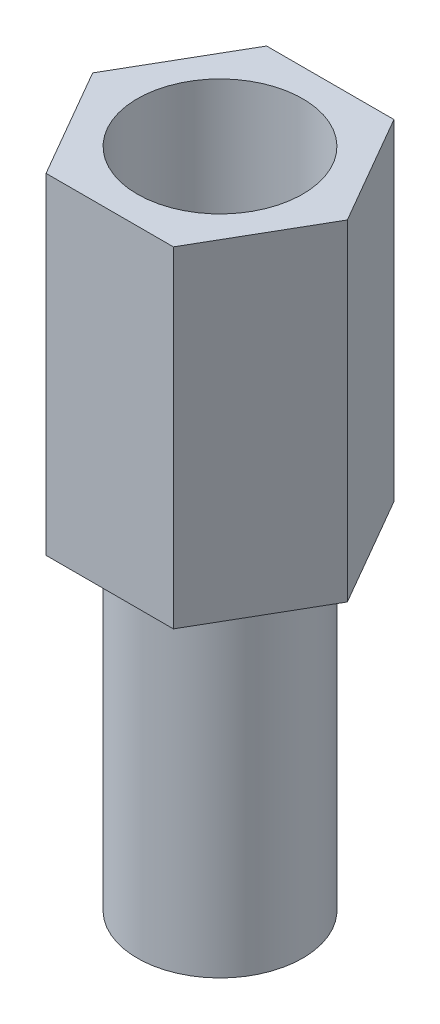
ISO-10303-21;
HEADER;
FILE_DESCRIPTION(('STEP AP214'),'2;1');
FILE_NAME('part.step','',(''),(''),'','','');
FILE_SCHEMA(('AUTOMOTIVE_DESIGN { 1 0 10303 214 1 1 1 1 }'));
ENDSEC;
DATA;
#1=APPLICATION_CONTEXT('core data for automotive mechanical design processes');
#2=APPLICATION_PROTOCOL_DEFINITION('international standard','automotive_design',2000,#1);
#3=PRODUCT_CONTEXT('',#1,'mechanical');
#4=PRODUCT('Part','Part','',(#3));
#5=PRODUCT_RELATED_PRODUCT_CATEGORY('part','',(#4));
#6=PRODUCT_DEFINITION_FORMATION('','',#4);
#7=PRODUCT_DEFINITION_CONTEXT('part definition',#1,'design');
#8=PRODUCT_DEFINITION('design','',#6,#7);
#9=PRODUCT_DEFINITION_SHAPE('','',#8);
#10=(LENGTH_UNIT() NAMED_UNIT(*) SI_UNIT(.MILLI.,.METRE.));
#11=(NAMED_UNIT(*) PLANE_ANGLE_UNIT() SI_UNIT($,.RADIAN.));
#12=(NAMED_UNIT(*) SI_UNIT($,.STERADIAN.) SOLID_ANGLE_UNIT());
#13=UNCERTAINTY_MEASURE_WITH_UNIT(LENGTH_MEASURE(1.E-05),#10,'distance_accuracy_value','');
#14=(GEOMETRIC_REPRESENTATION_CONTEXT(3) GLOBAL_UNCERTAINTY_ASSIGNED_CONTEXT((#13)) GLOBAL_UNIT_ASSIGNED_CONTEXT((#10,
#11,#12)) REPRESENTATION_CONTEXT('',''));
#15=CARTESIAN_POINT('',(0.,0.,0.));
#16=DIRECTION('',(0.,0.,1.));
#17=DIRECTION('',(1.,0.,0.));
#18=AXIS2_PLACEMENT_3D('',#15,#16,#17);
#19=CARTESIAN_POINT('',(0.,-6.,0.));
#20=DIRECTION('',(0.,1.,0.));
#21=DIRECTION('',(0.,0.,1.));
#22=AXIS2_PLACEMENT_3D('',#19,#20,#21);
#23=CYLINDRICAL_SURFACE('',#22,1.5);
#24=CARTESIAN_POINT('',(0.,-6.,0.));
#25=DIRECTION('',(0.,-1.,0.));
#26=DIRECTION('',(0.,0.,-1.));
#27=AXIS2_PLACEMENT_3D('',#24,#25,#26);
#28=CIRCLE('',#27,1.5);
#29=CARTESIAN_POINT('',(0.,-6.,-1.5));
#30=VERTEX_POINT('',#29);
#31=EDGE_CURVE('E11',#30,#30,#28,.T.);
#32=ORIENTED_EDGE('',*,*,#31,.F.);
#33=EDGE_LOOP('',(#32));
#34=FACE_BOUND('',#33,.T.);
#35=CARTESIAN_POINT('',(0.,0.,0.));
#36=DIRECTION('',(0.,-1.,0.));
#37=DIRECTION('',(0.,0.,-1.));
#38=AXIS2_PLACEMENT_3D('',#35,#36,#37);
#39=CIRCLE('',#38,1.5);
#40=CARTESIAN_POINT('',(0.,0.,-1.5));
#41=VERTEX_POINT('',#40);
#42=EDGE_CURVE('E43',#41,#41,#39,.T.);
#43=ORIENTED_EDGE('',*,*,#42,.T.);
#44=EDGE_LOOP('',(#43));
#45=FACE_BOUND('',#44,.T.);
#46=ADVANCED_FACE('F40',(#34,#45),#23,.T.);
#47=CARTESIAN_POINT('',(0.,-6.,0.));
#48=DIRECTION('',(0.,-1.,0.));
#49=DIRECTION('',(0.,0.,-1.));
#50=AXIS2_PLACEMENT_3D('',#47,#48,#49);
#51=PLANE('',#50);
#52=ORIENTED_EDGE('',*,*,#31,.T.);
#53=EDGE_LOOP('',(#52));
#54=FACE_BOUND('',#53,.T.);
#55=ADVANCED_FACE('F55',(#54),#51,.T.);
#56=CARTESIAN_POINT('',(0.,0.,0.));
#57=DIRECTION('',(0.,-1.,0.));
#58=DIRECTION('',(0.,0.,-1.));
#59=AXIS2_PLACEMENT_3D('',#56,#57,#58);
#60=PLANE('',#59);
#61=ORIENTED_EDGE('',*,*,#42,.F.);
#62=EDGE_LOOP('',(#61));
#63=FACE_BOUND('',#62,.T.);
#64=ADVANCED_FACE('F53',(#63),#60,.F.);
#65=CLOSED_SHELL('',(#46,#55,#64));
#66=MANIFOLD_SOLID_BREP('B2',#65);
#67=CARTESIAN_POINT('',(0.,6.,0.));
#68=DIRECTION('',(0.,1.,0.));
#69=DIRECTION('',(0.,0.,1.));
#70=AXIS2_PLACEMENT_3D('',#67,#68,#69);
#71=PLANE('',#70);
#72=DIRECTION('',(-0.5,0.,-0.866025403784439));
#73=VECTOR('',#72,1.);
#74=CARTESIAN_POINT('',(2.3094010767585,6.,0.));
#75=LINE('',#74,#73);
#76=CARTESIAN_POINT('',(2.3094010767585,6.,0.));
#77=VERTEX_POINT('',#76);
#78=CARTESIAN_POINT('',(1.15470053837925,6.,-2.));
#79=VERTEX_POINT('',#78);
#80=EDGE_CURVE('E176',#77,#79,#75,.T.);
#81=ORIENTED_EDGE('',*,*,#80,.T.);
#82=DIRECTION('',(-1.,0.,0.));
#83=VECTOR('',#82,1.);
#84=CARTESIAN_POINT('',(1.15470053837925,6.,-2.));
#85=LINE('',#84,#83);
#86=CARTESIAN_POINT('',(-1.15470053837925,6.,-2.));
#87=VERTEX_POINT('',#86);
#88=EDGE_CURVE('E134',#79,#87,#85,.T.);
#89=ORIENTED_EDGE('',*,*,#88,.T.);
#90=DIRECTION('',(-0.499999999999999,0.,0.866025403784439));
#91=VECTOR('',#90,1.);
#92=CARTESIAN_POINT('',(-1.15470053837925,6.,-2.));
#93=LINE('',#92,#91);
#94=CARTESIAN_POINT('',(-2.3094010767585,6.,0.));
#95=VERTEX_POINT('',#94);
#96=EDGE_CURVE('E147',#87,#95,#93,.T.);
#97=ORIENTED_EDGE('',*,*,#96,.T.);
#98=DIRECTION('',(0.5,0.,0.866025403784438));
#99=VECTOR('',#98,1.);
#100=CARTESIAN_POINT('',(-2.3094010767585,6.,0.));
#101=LINE('',#100,#99);
#102=CARTESIAN_POINT('',(-1.15470053837925,6.,2.));
#103=VERTEX_POINT('',#102);
#104=EDGE_CURVE('E141',#95,#103,#101,.T.);
#105=ORIENTED_EDGE('',*,*,#104,.T.);
#106=DIRECTION('',(1.,0.,0.));
#107=VECTOR('',#106,1.);
#108=CARTESIAN_POINT('',(-1.15470053837925,6.,2.));
#109=LINE('',#108,#107);
#110=CARTESIAN_POINT('',(1.15470053837925,6.,2.));
#111=VERTEX_POINT('',#110);
#112=EDGE_CURVE('E145',#103,#111,#109,.T.);
#113=ORIENTED_EDGE('',*,*,#112,.T.);
#114=DIRECTION('',(0.5,0.,-0.866025403784439));
#115=VECTOR('',#114,1.);
#116=CARTESIAN_POINT('',(1.15470053837925,6.,2.));
#117=LINE('',#116,#115);
#118=EDGE_CURVE('E97',#111,#77,#117,.T.);
#119=ORIENTED_EDGE('',*,*,#118,.T.);
#120=EDGE_LOOP('',(#81,#89,#97,#105,#113,#119));
#121=FACE_BOUND('',#120,.T.);
#122=CARTESIAN_POINT('',(0.,6.,0.));
#123=DIRECTION('',(0.,1.,0.));
#124=DIRECTION('',(0.,0.,1.));
#125=AXIS2_PLACEMENT_3D('',#122,#123,#124);
#126=CIRCLE('',#125,1.5);
#127=CARTESIAN_POINT('',(0.,6.,1.5));
#128=VERTEX_POINT('',#127);
#129=EDGE_CURVE('E169',#128,#128,#126,.T.);
#130=ORIENTED_EDGE('',*,*,#129,.F.);
#131=EDGE_LOOP('',(#130));
#132=FACE_BOUND('',#131,.T.);
#133=ADVANCED_FACE('F80',(#121,#132),#71,.T.);
#134=CARTESIAN_POINT('',(0.,0.,0.));
#135=DIRECTION('',(0.,1.,0.));
#136=DIRECTION('',(0.,0.,1.));
#137=AXIS2_PLACEMENT_3D('',#134,#135,#136);
#138=PLANE('',#137);
#139=DIRECTION('',(-0.5,0.,-0.866025403784439));
#140=VECTOR('',#139,1.);
#141=CARTESIAN_POINT('',(2.3094010767585,0.,0.));
#142=LINE('',#141,#140);
#143=CARTESIAN_POINT('',(2.3094010767585,0.,0.));
#144=VERTEX_POINT('',#143);
#145=CARTESIAN_POINT('',(1.15470053837925,0.,-2.));
#146=VERTEX_POINT('',#145);
#147=EDGE_CURVE('E165',#144,#146,#142,.T.);
#148=ORIENTED_EDGE('',*,*,#147,.F.);
#149=DIRECTION('',(0.5,0.,-0.866025403784439));
#150=VECTOR('',#149,1.);
#151=CARTESIAN_POINT('',(1.15470053837925,0.,2.));
#152=LINE('',#151,#150);
#153=CARTESIAN_POINT('',(1.15470053837925,0.,2.));
#154=VERTEX_POINT('',#153);
#155=EDGE_CURVE('E126',#154,#144,#152,.T.);
#156=ORIENTED_EDGE('',*,*,#155,.F.);
#157=DIRECTION('',(1.,0.,0.));
#158=VECTOR('',#157,1.);
#159=CARTESIAN_POINT('',(-1.15470053837925,0.,2.));
#160=LINE('',#159,#158);
#161=CARTESIAN_POINT('',(-1.15470053837925,0.,2.));
#162=VERTEX_POINT('',#161);
#163=EDGE_CURVE('E120',#162,#154,#160,.T.);
#164=ORIENTED_EDGE('',*,*,#163,.F.);
#165=DIRECTION('',(0.5,0.,0.866025403784438));
#166=VECTOR('',#165,1.);
#167=CARTESIAN_POINT('',(-2.3094010767585,0.,0.));
#168=LINE('',#167,#166);
#169=CARTESIAN_POINT('',(-2.3094010767585,0.,0.));
#170=VERTEX_POINT('',#169);
#171=EDGE_CURVE('E155',#170,#162,#168,.T.);
#172=ORIENTED_EDGE('',*,*,#171,.F.);
#173=DIRECTION('',(-0.499999999999999,0.,0.866025403784439));
#174=VECTOR('',#173,1.);
#175=CARTESIAN_POINT('',(-1.15470053837925,0.,-2.));
#176=LINE('',#175,#174);
#177=CARTESIAN_POINT('',(-1.15470053837925,0.,-2.));
#178=VERTEX_POINT('',#177);
#179=EDGE_CURVE('E171',#178,#170,#176,.T.);
#180=ORIENTED_EDGE('',*,*,#179,.F.);
#181=DIRECTION('',(-1.,0.,0.));
#182=VECTOR('',#181,1.);
#183=CARTESIAN_POINT('',(1.15470053837925,0.,-2.));
#184=LINE('',#183,#182);
#185=EDGE_CURVE('E168',#146,#178,#184,.T.);
#186=ORIENTED_EDGE('',*,*,#185,.F.);
#187=EDGE_LOOP('',(#148,#156,#164,#172,#180,#186));
#188=FACE_BOUND('',#187,.T.);
#189=CARTESIAN_POINT('',(0.,0.,0.));
#190=DIRECTION('',(0.,1.,0.));
#191=DIRECTION('',(0.,0.,1.));
#192=AXIS2_PLACEMENT_3D('',#189,#190,#191);
#193=CIRCLE('',#192,1.5);
#194=CARTESIAN_POINT('',(0.,0.,1.5));
#195=VERTEX_POINT('',#194);
#196=EDGE_CURVE('E269',#195,#195,#193,.T.);
#197=ORIENTED_EDGE('',*,*,#196,.T.);
#198=EDGE_LOOP('',(#197));
#199=FACE_BOUND('',#198,.T.);
#200=ADVANCED_FACE('F185',(#188,#199),#138,.F.);
#201=CARTESIAN_POINT('',(2.3094010767585,6.,0.));
#202=DIRECTION('',(-0.866025403784439,0.,0.5));
#203=DIRECTION('',(0.5,0.,0.866025403784439));
#204=AXIS2_PLACEMENT_3D('',#201,#202,#203);
#205=PLANE('',#204);
#206=ORIENTED_EDGE('',*,*,#147,.T.);
#207=DIRECTION('',(0.,-1.,0.));
#208=VECTOR('',#207,1.);
#209=CARTESIAN_POINT('',(1.15470053837925,6.,-2.));
#210=LINE('',#209,#208);
#211=EDGE_CURVE('E38',#79,#146,#210,.T.);
#212=ORIENTED_EDGE('',*,*,#211,.F.);
#213=ORIENTED_EDGE('',*,*,#80,.F.);
#214=DIRECTION('',(0.,-1.,0.));
#215=VECTOR('',#214,1.);
#216=CARTESIAN_POINT('',(2.3094010767585,6.,0.));
#217=LINE('',#216,#215);
#218=EDGE_CURVE('E161',#77,#144,#217,.T.);
#219=ORIENTED_EDGE('',*,*,#218,.T.);
#220=EDGE_LOOP('',(#206,#212,#213,#219));
#221=FACE_BOUND('',#220,.T.);
#222=ADVANCED_FACE('F82',(#221),#205,.F.);
#223=CARTESIAN_POINT('',(1.15470053837925,6.,-2.));
#224=DIRECTION('',(0.,0.,1.));
#225=DIRECTION('',(1.,0.,0.));
#226=AXIS2_PLACEMENT_3D('',#223,#224,#225);
#227=PLANE('',#226);
#228=ORIENTED_EDGE('',*,*,#185,.T.);
#229=DIRECTION('',(0.,-1.,0.));
#230=VECTOR('',#229,1.);
#231=CARTESIAN_POINT('',(-1.15470053837925,6.,-2.));
#232=LINE('',#231,#230);
#233=EDGE_CURVE('E89',#87,#178,#232,.T.);
#234=ORIENTED_EDGE('',*,*,#233,.F.);
#235=ORIENTED_EDGE('',*,*,#88,.F.);
#236=ORIENTED_EDGE('',*,*,#211,.T.);
#237=EDGE_LOOP('',(#228,#234,#235,#236));
#238=FACE_BOUND('',#237,.T.);
#239=ADVANCED_FACE('F210',(#238),#227,.F.);
#240=CARTESIAN_POINT('',(-1.15470053837925,6.,-2.));
#241=DIRECTION('',(0.866025403784439,0.,0.5));
#242=DIRECTION('',(0.5,0.,-0.866025403784439));
#243=AXIS2_PLACEMENT_3D('',#240,#241,#242);
#244=PLANE('',#243);
#245=ORIENTED_EDGE('',*,*,#179,.T.);
#246=DIRECTION('',(0.,-1.,0.));
#247=VECTOR('',#246,1.);
#248=CARTESIAN_POINT('',(-2.3094010767585,6.,0.));
#249=LINE('',#248,#247);
#250=EDGE_CURVE('E156',#95,#170,#249,.T.);
#251=ORIENTED_EDGE('',*,*,#250,.F.);
#252=ORIENTED_EDGE('',*,*,#96,.F.);
#253=ORIENTED_EDGE('',*,*,#233,.T.);
#254=EDGE_LOOP('',(#245,#251,#252,#253));
#255=FACE_BOUND('',#254,.T.);
#256=ADVANCED_FACE('F182',(#255),#244,.F.);
#257=CARTESIAN_POINT('',(-2.3094010767585,6.,0.));
#258=DIRECTION('',(0.866025403784438,0.,-0.5));
#259=DIRECTION('',(-0.5,0.,-0.866025403784438));
#260=AXIS2_PLACEMENT_3D('',#257,#258,#259);
#261=PLANE('',#260);
#262=ORIENTED_EDGE('',*,*,#171,.T.);
#263=DIRECTION('',(0.,-1.,0.));
#264=VECTOR('',#263,1.);
#265=CARTESIAN_POINT('',(-1.15470053837925,6.,2.));
#266=LINE('',#265,#264);
#267=EDGE_CURVE('E152',#103,#162,#266,.T.);
#268=ORIENTED_EDGE('',*,*,#267,.F.);
#269=ORIENTED_EDGE('',*,*,#104,.F.);
#270=ORIENTED_EDGE('',*,*,#250,.T.);
#271=EDGE_LOOP('',(#262,#268,#269,#270));
#272=FACE_BOUND('',#271,.T.);
#273=ADVANCED_FACE('F153',(#272),#261,.F.);
#274=CARTESIAN_POINT('',(-1.15470053837925,6.,2.));
#275=DIRECTION('',(0.,0.,-1.));
#276=DIRECTION('',(-1.,0.,0.));
#277=AXIS2_PLACEMENT_3D('',#274,#275,#276);
#278=PLANE('',#277);
#279=ORIENTED_EDGE('',*,*,#163,.T.);
#280=DIRECTION('',(0.,-1.,0.));
#281=VECTOR('',#280,1.);
#282=CARTESIAN_POINT('',(1.15470053837925,6.,2.));
#283=LINE('',#282,#281);
#284=EDGE_CURVE('E157',#111,#154,#283,.T.);
#285=ORIENTED_EDGE('',*,*,#284,.F.);
#286=ORIENTED_EDGE('',*,*,#112,.F.);
#287=ORIENTED_EDGE('',*,*,#267,.T.);
#288=EDGE_LOOP('',(#279,#285,#286,#287));
#289=FACE_BOUND('',#288,.T.);
#290=ADVANCED_FACE('F159',(#289),#278,.F.);
#291=CARTESIAN_POINT('',(1.15470053837925,6.,2.));
#292=DIRECTION('',(-0.866025403784439,0.,-0.5));
#293=DIRECTION('',(-0.5,0.,0.866025403784439));
#294=AXIS2_PLACEMENT_3D('',#291,#292,#293);
#295=PLANE('',#294);
#296=ORIENTED_EDGE('',*,*,#155,.T.);
#297=ORIENTED_EDGE('',*,*,#218,.F.);
#298=ORIENTED_EDGE('',*,*,#118,.F.);
#299=ORIENTED_EDGE('',*,*,#284,.T.);
#300=EDGE_LOOP('',(#296,#297,#298,#299));
#301=FACE_BOUND('',#300,.T.);
#302=ADVANCED_FACE('F190',(#301),#295,.F.);
#303=CARTESIAN_POINT('',(0.,6.,0.));
#304=DIRECTION('',(0.,-1.,0.));
#305=DIRECTION('',(0.,0.,-1.));
#306=AXIS2_PLACEMENT_3D('',#303,#304,#305);
#307=CYLINDRICAL_SURFACE('',#306,1.5);
#308=ORIENTED_EDGE('',*,*,#129,.T.);
#309=EDGE_LOOP('',(#308));
#310=FACE_BOUND('',#309,.T.);
#311=ORIENTED_EDGE('',*,*,#196,.F.);
#312=EDGE_LOOP('',(#311));
#313=FACE_BOUND('',#312,.T.);
#314=ADVANCED_FACE('F192',(#310,#313),#307,.F.);
#315=CLOSED_SHELL('',(#133,#200,#222,#239,#256,#273,#290,#302,#314));
#316=MANIFOLD_SOLID_BREP('B6',#315);
#317=ADVANCED_BREP_SHAPE_REPRESENTATION('',(#18,#66,#316),#14);
#318=SHAPE_DEFINITION_REPRESENTATION(#9,#317);
ENDSEC;
END-ISO-10303-21;
